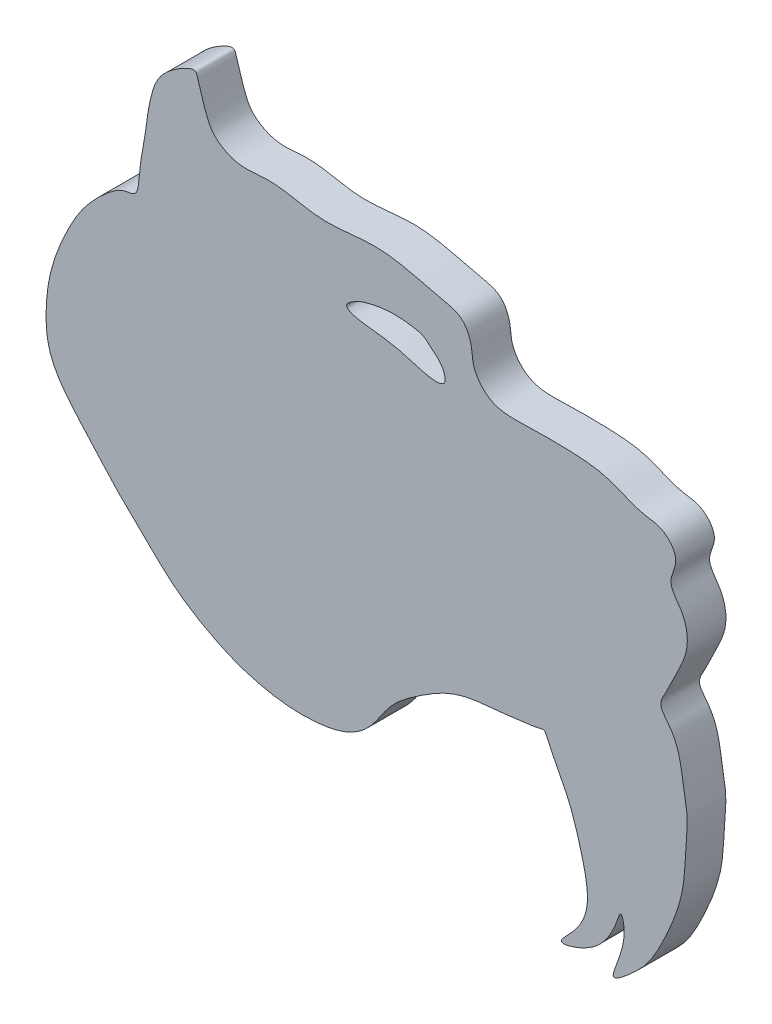
ISO-10303-21;
HEADER;
FILE_DESCRIPTION(('STEP AP214'),'2;1');
FILE_NAME('part.step','',(''),(''),'','','');
FILE_SCHEMA(('AUTOMOTIVE_DESIGN { 1 0 10303 214 1 1 1 1 }'));
ENDSEC;
DATA;
#1=APPLICATION_CONTEXT('core data for automotive mechanical design processes');
#2=APPLICATION_PROTOCOL_DEFINITION('international standard','automotive_design',2000,#1);
#3=PRODUCT_CONTEXT('',#1,'mechanical');
#4=PRODUCT('Part','Part','',(#3));
#5=PRODUCT_RELATED_PRODUCT_CATEGORY('part','',(#4));
#6=PRODUCT_DEFINITION_FORMATION('','',#4);
#7=PRODUCT_DEFINITION_CONTEXT('part definition',#1,'design');
#8=PRODUCT_DEFINITION('design','',#6,#7);
#9=PRODUCT_DEFINITION_SHAPE('','',#8);
#10=(LENGTH_UNIT() NAMED_UNIT(*) SI_UNIT(.MILLI.,.METRE.));
#11=(NAMED_UNIT(*) PLANE_ANGLE_UNIT() SI_UNIT($,.RADIAN.));
#12=(NAMED_UNIT(*) SI_UNIT($,.STERADIAN.) SOLID_ANGLE_UNIT());
#13=UNCERTAINTY_MEASURE_WITH_UNIT(LENGTH_MEASURE(1.E-05),#10,'distance_accuracy_value','');
#14=(GEOMETRIC_REPRESENTATION_CONTEXT(3) GLOBAL_UNCERTAINTY_ASSIGNED_CONTEXT((#13)) GLOBAL_UNIT_ASSIGNED_CONTEXT((#10,
#11,#12)) REPRESENTATION_CONTEXT('',''));
#15=CARTESIAN_POINT('',(0.,0.,0.));
#16=DIRECTION('',(0.,0.,1.));
#17=DIRECTION('',(1.,0.,0.));
#18=AXIS2_PLACEMENT_3D('',#15,#16,#17);
#19=CARTESIAN_POINT('',(-12.3700451227218,24.1348685166527,3.));
#20=CARTESIAN_POINT('',(-12.2746185017267,24.8233558357932,3.));
#21=CARTESIAN_POINT('',(-11.9724953861875,26.1451183019241,3.));
#22=CARTESIAN_POINT('',(-11.7382457666422,28.6156811737788,3.));
#23=CARTESIAN_POINT('',(-10.8810272060705,31.0369988723787,3.));
#24=CARTESIAN_POINT('',(-8.1651270341898,32.6642044771997,3.));
#25=CARTESIAN_POINT('',(-7.94990459336901,32.0512569288813,3.));
#26=CARTESIAN_POINT('',(-7.29226002843308,29.6681302212608,3.));
#27=CARTESIAN_POINT('',(-6.62050964220629,28.5785950271077,3.));
#28=CARTESIAN_POINT('',(-4.62055699522735,27.508599360696,3.));
#29=CARTESIAN_POINT('',(-2.09934832658308,28.183828391644,3.));
#30=CARTESIAN_POINT('',(1.7053915518125,26.9007220096876,3.));
#31=CARTESIAN_POINT('',(5.15064415970335,27.7230177104305,3.));
#32=CARTESIAN_POINT('',(8.37334760718635,27.2887982846312,3.));
#33=CARTESIAN_POINT('',(10.4248084595756,26.6830529260438,3.));
#34=CARTESIAN_POINT('',(12.755274161079,26.2508939244764,3.));
#35=CARTESIAN_POINT('',(13.3675280465751,24.7157858091735,3.));
#36=CARTESIAN_POINT('',(13.3997550933916,23.0311070972716,3.));
#37=CARTESIAN_POINT('',(14.798007004389,21.2549897633675,3.));
#38=CARTESIAN_POINT('',(17.8248707594809,21.3651337244628,3.));
#39=CARTESIAN_POINT('',(20.8146638430889,21.4014952254324,3.));
#40=CARTESIAN_POINT('',(24.0468937288162,21.1454318736876,3.));
#41=CARTESIAN_POINT('',(26.1836681898827,19.919724830916,3.));
#42=CARTESIAN_POINT('',(28.2561590980495,19.8366742818303,3.));
#43=CARTESIAN_POINT('',(29.6535981331507,18.1855233827449,3.));
#44=CARTESIAN_POINT('',(28.3855532424891,16.3852775252454,3.));
#45=CARTESIAN_POINT('',(29.9681623808032,14.7848970110022,3.));
#46=CARTESIAN_POINT('',(30.3165073009076,12.3089164739325,3.));
#47=CARTESIAN_POINT('',(29.1328535054449,10.4276825076331,3.));
#48=CARTESIAN_POINT('',(28.5082236235617,8.90320557678766,3.));
#49=CARTESIAN_POINT('',(27.7262922301635,7.77449130876999,3.));
#50=CARTESIAN_POINT('',(29.6130785953411,5.88752306503423,3.));
#51=CARTESIAN_POINT('',(29.6273051813717,3.73037981587049,3.));
#52=CARTESIAN_POINT('',(30.181294557003,1.13186494137269,3.));
#53=CARTESIAN_POINT('',(29.9205229426653,-0.809606114098007,3.));
#54=CARTESIAN_POINT('',(29.8906271856909,-4.02699283707535,3.));
#55=CARTESIAN_POINT('',(28.7084374059631,-7.07125674712675,3.));
#56=CARTESIAN_POINT('',(27.3262802670406,-9.77965947045687,3.));
#57=CARTESIAN_POINT('',(26.0957204453828,-11.1560015358405,3.));
#58=CARTESIAN_POINT('',(23.6242769138948,-13.244588805549,3.));
#59=CARTESIAN_POINT('',(25.2661038343036,-10.1285499450283,3.));
#60=CARTESIAN_POINT('',(25.217113138566,-8.34201682216694,3.));
#61=CARTESIAN_POINT('',(24.8696495379426,-7.62085151740734,3.));
#62=CARTESIAN_POINT('',(24.5144231142246,-8.96573651831378,3.));
#63=CARTESIAN_POINT('',(23.6322234421804,-10.4234303677412,3.));
#64=CARTESIAN_POINT('',(22.0565914153885,-11.7544024599471,3.));
#65=CARTESIAN_POINT('',(19.4457643047301,-12.4657883742502,3.));
#66=CARTESIAN_POINT('',(21.4205349556637,-10.8112561758379,3.));
#67=CARTESIAN_POINT('',(22.6736339701884,-8.56881865335649,3.));
#68=CARTESIAN_POINT('',(21.7686687737344,-4.7305244144406,3.));
#69=CARTESIAN_POINT('',(21.192741839672,-2.97187766265345,3.));
#70=CARTESIAN_POINT('',(20.7323217238649,-1.8521560902784,3.));
#71=CARTESIAN_POINT('',(18.867852363572,1.70184579150732,3.));
#72=CARTESIAN_POINT('',(19.1839969208188,1.61845554231842,3.));
#73=CARTESIAN_POINT('',(17.8710633375237,1.35163390825893,3.));
#74=CARTESIAN_POINT('',(17.424360264824,1.34616137515735,3.));
#75=CARTESIAN_POINT('',(16.8372309587924,1.22987250016451,3.));
#76=CARTESIAN_POINT('',(14.3562112760196,0.948803558453627,3.));
#77=CARTESIAN_POINT('',(12.0874630078294,0.840448268781345,3.));
#78=CARTESIAN_POINT('',(8.43098271582683,-1.47680271748933,3.));
#79=CARTESIAN_POINT('',(6.4405525438755,-3.10355484175512,3.));
#80=CARTESIAN_POINT('',(4.88660826043502,-6.5363851560952,3.));
#81=CARTESIAN_POINT('',(-0.545486909912631,-6.92244038460596,3.));
#82=CARTESIAN_POINT('',(-4.23500505667784,-6.20077804725415,3.));
#83=CARTESIAN_POINT('',(-6.87552545691646,-5.03272144093152,3.));
#84=CARTESIAN_POINT('',(-9.65639547624354,-3.41496867068339,3.));
#85=CARTESIAN_POINT('',(-12.3861607498202,-0.631910356488406,3.));
#86=CARTESIAN_POINT('',(-14.1990460985296,1.03386796539091,3.));
#87=CARTESIAN_POINT('',(-16.4741593159265,3.68860234115329,3.));
#88=CARTESIAN_POINT('',(-19.6427316075989,6.9990053596025,3.));
#89=CARTESIAN_POINT('',(-19.8047464398491,10.9709629441793,3.));
#90=CARTESIAN_POINT('',(-19.3325082054185,13.9157037764304,3.));
#91=CARTESIAN_POINT('',(-17.8752040115813,17.2079831750877,3.));
#92=CARTESIAN_POINT('',(-16.4552340641254,19.4087555531671,3.));
#93=CARTESIAN_POINT('',(-13.6424952376602,22.042234909019,3.));
#94=CARTESIAN_POINT('',(-12.536714535484,21.3008106032681,3.));
#95=CARTESIAN_POINT('',(-12.4728790744172,23.3929385291809,3.));
#96=CARTESIAN_POINT('',(-12.3700451227218,24.1348685166527,3.));
#97=B_SPLINE_CURVE_WITH_KNOTS('',3,(#19,#20,#21,#22,#23,#24,#25,#26,#27,#28,#29,#30,#31,#32,#33,
#34,#35,#36,#37,#38,#39,#40,#41,#42,#43,#44,#45,#46,#47,#48,#49,#50,#51,#52,#53,#54,#55,#56,#57,
#58,#59,#60,#61,#62,#63,#64,#65,#66,#67,#68,#69,#70,#71,#72,#73,#74,#75,#76,#77,#78,#79,#80,#81,
#82,#83,#84,#85,#86,#87,#88,#89,#90,#91,#92,#93,#94,#95,#96),.UNSPECIFIED.,.T.,.F.,(4,1,1,1,1,1,
1,1,1,1,1,1,1,1,1,1,1,1,1,1,1,1,1,1,1,1,1,1,1,1,1,1,1,1,1,1,1,1,1,1,1,1,1,1,1,1,1,1,1,1,1,1,1,1,
1,1,1,1,1,1,1,1,1,1,1,1,1,1,1,1,1,1,1,1,1,4),(0.,0.0104679919922422,0.019100119326669,
0.0235327960031104,0.0299091220837758,0.0356886253738842,0.0443207527083111,0.0510094298600866,
0.0543537684359744,0.0652463095241636,0.0797616011399596,0.0968852078063904,0.103539903313344,
0.115516336187136,0.121295839477244,0.128250394822051,0.13138477055877,0.140250123911653,
0.149267610733043,0.163263383386889,0.174259500888532,0.18458941543789,0.189776273689709,
0.197007840915944,0.20319959157666,0.209601365828334,0.218627340819328,0.229252304231904,
0.232978492403108,0.237622635584411,0.242156450977509,0.258582169962112,0.261442554502423,
0.270760296380619,0.280326297315549,0.296854135997756,0.306959328697345,0.312535369636709,
0.320215383034494,0.32876141044583,0.336289054246165,0.337573595287386,0.341606820858036,
0.348053737198536,0.353679652930524,0.367810363272778,0.375917640779094,0.384340280200906,
0.395217334370851,0.408547454746242,0.416271774258638,0.418769299203932,0.431883436977488,
0.43497842188767,0.446624163395562,0.450033919775026,0.467620267993815,0.508042246840908,
0.528005895499353,0.562481370380221,0.605947699624249,0.623742318574669,0.638826805627139,
0.665958168852288,0.709292149204903,0.735428133580966,0.764018517107896,0.788836444173827,
0.822912301993811,0.851947400396819,0.887977047864374,0.921674780386196,0.942945593671228,
0.966295852391803,0.988719447763604,0.999999999999999),.UNSPECIFIED.);
#98=DIRECTION('',(0.,0.,-1.));
#99=VECTOR('',#98,1.);
#100=SURFACE_OF_LINEAR_EXTRUSION('',#97,#99);
#101=CARTESIAN_POINT('',(-12.3700451227218,24.1348685166527,3.));
#102=VERTEX_POINT('',#101);
#103=EDGE_CURVE('E10',#102,#102,#97,.T.);
#104=ORIENTED_EDGE('',*,*,#103,.T.);
#105=EDGE_LOOP('',(#104));
#106=FACE_BOUND('',#105,.T.);
#107=CARTESIAN_POINT('',(-12.3700451227218,24.1348685166527,0.));
#108=CARTESIAN_POINT('',(-12.2746185017267,24.8233558357932,0.));
#109=CARTESIAN_POINT('',(-11.9724953861875,26.1451183019241,0.));
#110=CARTESIAN_POINT('',(-11.7382457666422,28.6156811737788,0.));
#111=CARTESIAN_POINT('',(-10.8810272060705,31.0369988723787,0.));
#112=CARTESIAN_POINT('',(-8.1651270341898,32.6642044771997,0.));
#113=CARTESIAN_POINT('',(-7.94990459336901,32.0512569288813,0.));
#114=CARTESIAN_POINT('',(-7.29226002843308,29.6681302212608,0.));
#115=CARTESIAN_POINT('',(-6.62050964220629,28.5785950271077,0.));
#116=CARTESIAN_POINT('',(-4.62055699522735,27.508599360696,0.));
#117=CARTESIAN_POINT('',(-2.09934832658308,28.183828391644,0.));
#118=CARTESIAN_POINT('',(1.7053915518125,26.9007220096876,0.));
#119=CARTESIAN_POINT('',(5.15064415970335,27.7230177104305,0.));
#120=CARTESIAN_POINT('',(8.37334760718635,27.2887982846312,0.));
#121=CARTESIAN_POINT('',(10.4248084595756,26.6830529260438,0.));
#122=CARTESIAN_POINT('',(12.755274161079,26.2508939244764,0.));
#123=CARTESIAN_POINT('',(13.3675280465751,24.7157858091735,0.));
#124=CARTESIAN_POINT('',(13.3997550933916,23.0311070972716,0.));
#125=CARTESIAN_POINT('',(14.798007004389,21.2549897633675,0.));
#126=CARTESIAN_POINT('',(17.8248707594809,21.3651337244628,0.));
#127=CARTESIAN_POINT('',(20.8146638430889,21.4014952254324,0.));
#128=CARTESIAN_POINT('',(24.0468937288162,21.1454318736876,0.));
#129=CARTESIAN_POINT('',(26.1836681898827,19.919724830916,0.));
#130=CARTESIAN_POINT('',(28.2561590980495,19.8366742818303,0.));
#131=CARTESIAN_POINT('',(29.6535981331507,18.1855233827449,0.));
#132=CARTESIAN_POINT('',(28.3855532424891,16.3852775252454,0.));
#133=CARTESIAN_POINT('',(29.9681623808032,14.7848970110022,0.));
#134=CARTESIAN_POINT('',(30.3165073009076,12.3089164739325,0.));
#135=CARTESIAN_POINT('',(29.1328535054449,10.4276825076331,0.));
#136=CARTESIAN_POINT('',(28.5082236235617,8.90320557678766,0.));
#137=CARTESIAN_POINT('',(27.7262922301635,7.77449130876999,0.));
#138=CARTESIAN_POINT('',(29.6130785953411,5.88752306503423,0.));
#139=CARTESIAN_POINT('',(29.6273051813717,3.73037981587049,0.));
#140=CARTESIAN_POINT('',(30.181294557003,1.13186494137269,0.));
#141=CARTESIAN_POINT('',(29.9205229426653,-0.809606114098007,0.));
#142=CARTESIAN_POINT('',(29.8906271856909,-4.02699283707535,0.));
#143=CARTESIAN_POINT('',(28.7084374059631,-7.07125674712675,0.));
#144=CARTESIAN_POINT('',(27.3262802670406,-9.77965947045687,0.));
#145=CARTESIAN_POINT('',(26.0957204453828,-11.1560015358405,0.));
#146=CARTESIAN_POINT('',(23.6242769138948,-13.244588805549,0.));
#147=CARTESIAN_POINT('',(25.2661038343036,-10.1285499450283,0.));
#148=CARTESIAN_POINT('',(25.217113138566,-8.34201682216694,0.));
#149=CARTESIAN_POINT('',(24.8696495379426,-7.62085151740734,0.));
#150=CARTESIAN_POINT('',(24.5144231142246,-8.96573651831378,0.));
#151=CARTESIAN_POINT('',(23.6322234421804,-10.4234303677412,0.));
#152=CARTESIAN_POINT('',(22.0565914153885,-11.7544024599471,0.));
#153=CARTESIAN_POINT('',(19.4457643047301,-12.4657883742502,0.));
#154=CARTESIAN_POINT('',(21.4205349556637,-10.8112561758379,0.));
#155=CARTESIAN_POINT('',(22.6736339701884,-8.56881865335649,0.));
#156=CARTESIAN_POINT('',(21.7686687737344,-4.7305244144406,0.));
#157=CARTESIAN_POINT('',(21.192741839672,-2.97187766265345,0.));
#158=CARTESIAN_POINT('',(20.7323217238649,-1.8521560902784,0.));
#159=CARTESIAN_POINT('',(18.867852363572,1.70184579150732,0.));
#160=CARTESIAN_POINT('',(19.1839969208188,1.61845554231842,0.));
#161=CARTESIAN_POINT('',(17.8710633375237,1.35163390825893,0.));
#162=CARTESIAN_POINT('',(17.424360264824,1.34616137515735,0.));
#163=CARTESIAN_POINT('',(16.8372309587924,1.22987250016451,0.));
#164=CARTESIAN_POINT('',(14.3562112760196,0.948803558453627,0.));
#165=CARTESIAN_POINT('',(12.0874630078294,0.840448268781345,0.));
#166=CARTESIAN_POINT('',(8.43098271582683,-1.47680271748933,0.));
#167=CARTESIAN_POINT('',(6.4405525438755,-3.10355484175512,0.));
#168=CARTESIAN_POINT('',(4.88660826043502,-6.5363851560952,0.));
#169=CARTESIAN_POINT('',(-0.545486909912631,-6.92244038460596,0.));
#170=CARTESIAN_POINT('',(-4.23500505667784,-6.20077804725415,0.));
#171=CARTESIAN_POINT('',(-6.87552545691646,-5.03272144093152,0.));
#172=CARTESIAN_POINT('',(-9.65639547624354,-3.41496867068339,0.));
#173=CARTESIAN_POINT('',(-12.3861607498202,-0.631910356488406,0.));
#174=CARTESIAN_POINT('',(-14.1990460985296,1.03386796539091,0.));
#175=CARTESIAN_POINT('',(-16.4741593159265,3.68860234115329,0.));
#176=CARTESIAN_POINT('',(-19.6427316075989,6.9990053596025,0.));
#177=CARTESIAN_POINT('',(-19.8047464398491,10.9709629441793,0.));
#178=CARTESIAN_POINT('',(-19.3325082054185,13.9157037764304,0.));
#179=CARTESIAN_POINT('',(-17.8752040115813,17.2079831750877,0.));
#180=CARTESIAN_POINT('',(-16.4552340641254,19.4087555531671,0.));
#181=CARTESIAN_POINT('',(-13.6424952376602,22.042234909019,0.));
#182=CARTESIAN_POINT('',(-12.536714535484,21.3008106032681,0.));
#183=CARTESIAN_POINT('',(-12.4728790744172,23.3929385291809,0.));
#184=CARTESIAN_POINT('',(-12.3700451227218,24.1348685166527,0.));
#185=B_SPLINE_CURVE_WITH_KNOTS('',3,(#107,#108,#109,#110,#111,#112,#113,#114,#115,#116,#117,
#118,#119,#120,#121,#122,#123,#124,#125,#126,#127,#128,#129,#130,#131,#132,#133,#134,#135,#136,
#137,#138,#139,#140,#141,#142,#143,#144,#145,#146,#147,#148,#149,#150,#151,#152,#153,#154,#155,
#156,#157,#158,#159,#160,#161,#162,#163,#164,#165,#166,#167,#168,#169,#170,#171,#172,#173,#174,
#175,#176,#177,#178,#179,#180,#181,#182,#183,#184),.UNSPECIFIED.,.T.,.F.,(4,1,1,1,1,1,1,1,1,1,1,
1,1,1,1,1,1,1,1,1,1,1,1,1,1,1,1,1,1,1,1,1,1,1,1,1,1,1,1,1,1,1,1,1,1,1,1,1,1,1,1,1,1,1,1,1,1,1,1,
1,1,1,1,1,1,1,1,1,1,1,1,1,1,1,1,4),(0.,0.0104679919922422,0.019100119326669,0.0235327960031104,
0.0299091220837758,0.0356886253738842,0.0443207527083111,0.0510094298600866,0.0543537684359744,
0.0652463095241636,0.0797616011399596,0.0968852078063904,0.103539903313344,0.115516336187136,
0.121295839477244,0.128250394822051,0.13138477055877,0.140250123911653,0.149267610733043,
0.163263383386889,0.174259500888532,0.18458941543789,0.189776273689709,0.197007840915944,
0.20319959157666,0.209601365828334,0.218627340819328,0.229252304231904,0.232978492403108,
0.237622635584411,0.242156450977509,0.258582169962112,0.261442554502423,0.270760296380619,
0.280326297315549,0.296854135997756,0.306959328697345,0.312535369636709,0.320215383034494,
0.32876141044583,0.336289054246165,0.337573595287386,0.341606820858036,0.348053737198536,
0.353679652930524,0.367810363272778,0.375917640779094,0.384340280200906,0.395217334370851,
0.408547454746242,0.416271774258638,0.418769299203932,0.431883436977488,0.43497842188767,
0.446624163395562,0.450033919775026,0.467620267993815,0.508042246840908,0.528005895499353,
0.562481370380221,0.605947699624249,0.623742318574669,0.638826805627139,0.665958168852288,
0.709292149204903,0.735428133580966,0.764018517107896,0.788836444173827,0.822912301993811,
0.851947400396819,0.887977047864374,0.921674780386196,0.942945593671228,0.966295852391803,
0.988719447763604,0.999999999999999),.UNSPECIFIED.);
#186=CARTESIAN_POINT('',(-12.3700451227218,24.1348685166527,0.));
#187=VERTEX_POINT('',#186);
#188=EDGE_CURVE('E39',#187,#187,#185,.T.);
#189=ORIENTED_EDGE('',*,*,#188,.F.);
#190=EDGE_LOOP('',(#189));
#191=FACE_BOUND('',#190,.T.);
#192=ADVANCED_FACE('F35',(#106,#191),#100,.T.);
#193=CARTESIAN_POINT('',(12.0652959852836,0.525835412480321,3.));
#194=DIRECTION('',(0.,0.,1.));
#195=DIRECTION('',(1.,0.,0.));
#196=AXIS2_PLACEMENT_3D('',#193,#194,#195);
#197=PLANE('',#196);
#198=CARTESIAN_POINT('',(10.1999210204699,22.8817645224882,3.));
#199=CARTESIAN_POINT('',(10.227809664031,22.8577519184563,3.));
#200=CARTESIAN_POINT('',(10.4450449180251,22.6932401395784,3.));
#201=CARTESIAN_POINT('',(11.0892919662176,22.1906451060534,3.));
#202=CARTESIAN_POINT('',(11.6412378532617,20.1661683295972,3.));
#203=CARTESIAN_POINT('',(7.77445210459871,21.6195616153143,3.));
#204=CARTESIAN_POINT('',(6.1411427000096,21.7413904739448,3.));
#205=CARTESIAN_POINT('',(2.91562115363319,22.167143879415,3.));
#206=CARTESIAN_POINT('',(4.41232429600819,23.184847044287,3.));
#207=CARTESIAN_POINT('',(5.64011360092597,23.5643052481166,3.));
#208=CARTESIAN_POINT('',(7.25713673404913,23.8308928792729,3.));
#209=CARTESIAN_POINT('',(8.91860592397856,23.5723371632654,3.));
#210=CARTESIAN_POINT('',(9.2481957047995,23.5207900303474,3.));
#211=CARTESIAN_POINT('',(9.7821191942466,23.2945610291481,3.));
#212=CARTESIAN_POINT('',(10.0798241246722,22.9851700250875,3.));
#213=CARTESIAN_POINT('',(10.1999210204699,22.8817645224882,3.));
#214=B_SPLINE_CURVE_WITH_KNOTS('',3,(#198,#199,#200,#201,#202,#203,#204,#205,#206,#207,#208,
#209,#210,#211,#212,#213),.UNSPECIFIED.,.T.,.F.,(4,1,1,1,1,1,1,1,1,1,1,1,1,4),(0.,
0.00808886319307045,0.0808886319307048,0.123045935829754,0.321633902788877,0.448443472610135,
0.574422411394643,0.62756060082718,0.683573170608616,0.814642700662958,0.905971304510942,
0.955764050172715,0.965166919721621,1.),.UNSPECIFIED.);
#215=CARTESIAN_POINT('',(10.1999210204699,22.8817645224882,3.));
#216=VERTEX_POINT('',#215);
#217=EDGE_CURVE('E47',#216,#216,#214,.T.);
#218=ORIENTED_EDGE('',*,*,#217,.T.);
#219=EDGE_LOOP('',(#218));
#220=FACE_BOUND('',#219,.T.);
#221=ORIENTED_EDGE('',*,*,#103,.F.);
#222=EDGE_LOOP('',(#221));
#223=FACE_BOUND('',#222,.T.);
#224=ADVANCED_FACE('F76',(#220,#223),#197,.T.);
#225=CARTESIAN_POINT('',(12.0652959852836,0.525835412480321,0.));
#226=DIRECTION('',(0.,0.,1.));
#227=DIRECTION('',(1.,0.,0.));
#228=AXIS2_PLACEMENT_3D('',#225,#226,#227);
#229=PLANE('',#228);
#230=CARTESIAN_POINT('',(10.1999210204699,22.8817645224882,0.));
#231=CARTESIAN_POINT('',(10.227809664031,22.8577519184563,0.));
#232=CARTESIAN_POINT('',(10.4450449180251,22.6932401395784,0.));
#233=CARTESIAN_POINT('',(11.0892919662176,22.1906451060534,0.));
#234=CARTESIAN_POINT('',(11.6412378532617,20.1661683295972,0.));
#235=CARTESIAN_POINT('',(7.77445210459871,21.6195616153143,0.));
#236=CARTESIAN_POINT('',(6.1411427000096,21.7413904739448,0.));
#237=CARTESIAN_POINT('',(2.91562115363319,22.167143879415,0.));
#238=CARTESIAN_POINT('',(4.41232429600819,23.184847044287,0.));
#239=CARTESIAN_POINT('',(5.64011360092597,23.5643052481166,0.));
#240=CARTESIAN_POINT('',(7.25713673404913,23.8308928792729,0.));
#241=CARTESIAN_POINT('',(8.91860592397856,23.5723371632654,0.));
#242=CARTESIAN_POINT('',(9.2481957047995,23.5207900303474,0.));
#243=CARTESIAN_POINT('',(9.7821191942466,23.2945610291481,0.));
#244=CARTESIAN_POINT('',(10.0798241246722,22.9851700250875,0.));
#245=CARTESIAN_POINT('',(10.1999210204699,22.8817645224882,0.));
#246=B_SPLINE_CURVE_WITH_KNOTS('',3,(#230,#231,#232,#233,#234,#235,#236,#237,#238,#239,#240,
#241,#242,#243,#244,#245),.UNSPECIFIED.,.T.,.F.,(4,1,1,1,1,1,1,1,1,1,1,1,1,4),(0.,
0.00808886319307045,0.0808886319307048,0.123045935829754,0.321633902788877,0.448443472610135,
0.574422411394643,0.62756060082718,0.683573170608616,0.814642700662958,0.905971304510942,
0.955764050172715,0.965166919721621,1.),.UNSPECIFIED.);
#247=CARTESIAN_POINT('',(10.1999210204699,22.8817645224882,0.));
#248=VERTEX_POINT('',#247);
#249=EDGE_CURVE('E52',#248,#248,#246,.T.);
#250=ORIENTED_EDGE('',*,*,#249,.F.);
#251=EDGE_LOOP('',(#250));
#252=FACE_BOUND('',#251,.T.);
#253=ORIENTED_EDGE('',*,*,#188,.T.);
#254=EDGE_LOOP('',(#253));
#255=FACE_BOUND('',#254,.T.);
#256=ADVANCED_FACE('F74',(#252,#255),#229,.F.);
#257=DIRECTION('',(0.,0.,-1.));
#258=VECTOR('',#257,1.);
#259=SURFACE_OF_LINEAR_EXTRUSION('',#214,#258);
#260=ORIENTED_EDGE('',*,*,#217,.F.);
#261=EDGE_LOOP('',(#260));
#262=FACE_BOUND('',#261,.T.);
#263=ORIENTED_EDGE('',*,*,#249,.T.);
#264=EDGE_LOOP('',(#263));
#265=FACE_BOUND('',#264,.T.);
#266=ADVANCED_FACE('F71',(#262,#265),#259,.F.);
#267=CLOSED_SHELL('',(#192,#224,#256,#266));
#268=MANIFOLD_SOLID_BREP('B2',#267);
#269=ADVANCED_BREP_SHAPE_REPRESENTATION('',(#18,#268),#14);
#270=SHAPE_DEFINITION_REPRESENTATION(#9,#269);
ENDSEC;
END-ISO-10303-21;
